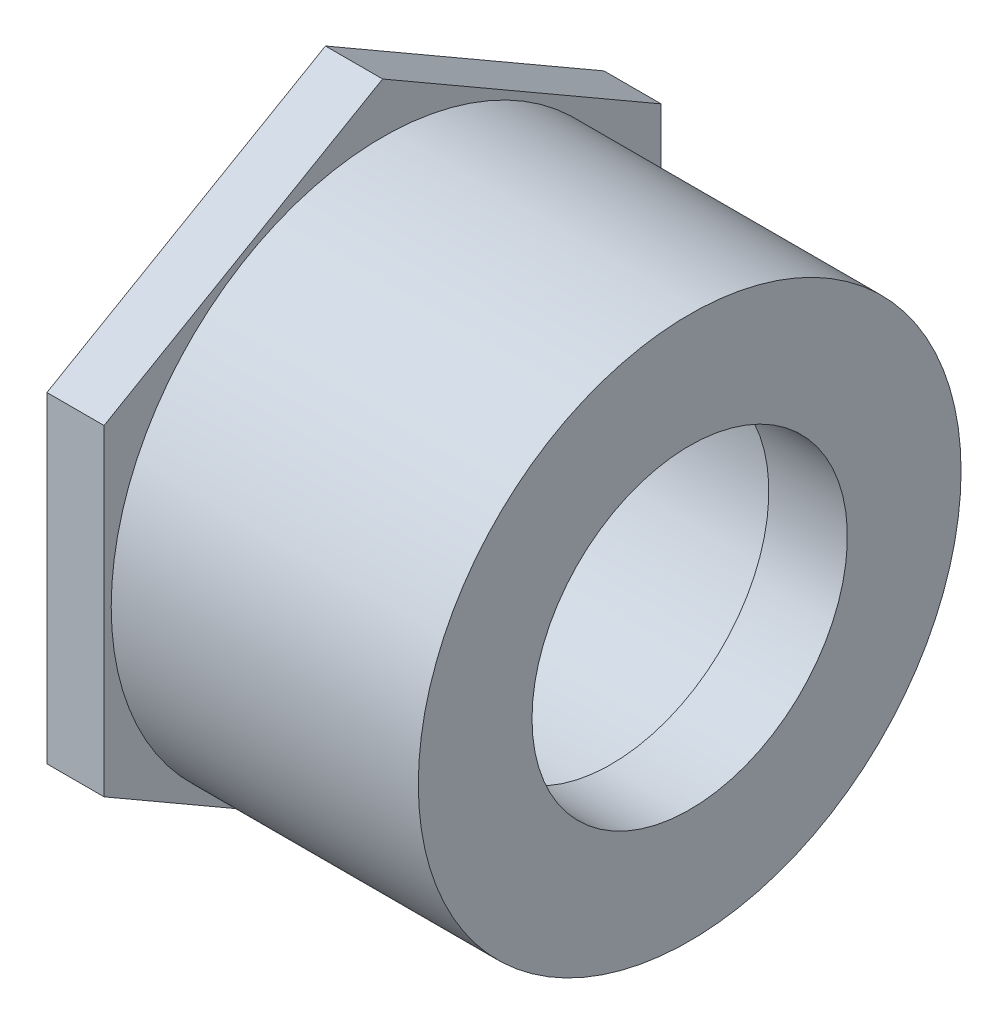
ISO-10303-21;
HEADER;
FILE_DESCRIPTION(('STEP AP214'),'2;1');
FILE_NAME('part.step','',(''),(''),'','','');
FILE_SCHEMA(('AUTOMOTIVE_DESIGN { 1 0 10303 214 1 1 1 1 }'));
ENDSEC;
DATA;
#1=APPLICATION_CONTEXT('core data for automotive mechanical design processes');
#2=APPLICATION_PROTOCOL_DEFINITION('international standard','automotive_design',2000,#1);
#3=PRODUCT_CONTEXT('',#1,'mechanical');
#4=PRODUCT('Part','Part','',(#3));
#5=PRODUCT_RELATED_PRODUCT_CATEGORY('part','',(#4));
#6=PRODUCT_DEFINITION_FORMATION('','',#4);
#7=PRODUCT_DEFINITION_CONTEXT('part definition',#1,'design');
#8=PRODUCT_DEFINITION('design','',#6,#7);
#9=PRODUCT_DEFINITION_SHAPE('','',#8);
#10=(LENGTH_UNIT() NAMED_UNIT(*) SI_UNIT(.MILLI.,.METRE.));
#11=(NAMED_UNIT(*) PLANE_ANGLE_UNIT() SI_UNIT($,.RADIAN.));
#12=(NAMED_UNIT(*) SI_UNIT($,.STERADIAN.) SOLID_ANGLE_UNIT());
#13=UNCERTAINTY_MEASURE_WITH_UNIT(LENGTH_MEASURE(1.E-05),#10,'distance_accuracy_value','');
#14=(GEOMETRIC_REPRESENTATION_CONTEXT(3) GLOBAL_UNCERTAINTY_ASSIGNED_CONTEXT((#13)) GLOBAL_UNIT_ASSIGNED_CONTEXT((#10,
#11,#12)) REPRESENTATION_CONTEXT('',''));
#15=CARTESIAN_POINT('',(0.,0.,0.));
#16=DIRECTION('',(0.,0.,1.));
#17=DIRECTION('',(1.,0.,0.));
#18=AXIS2_PLACEMENT_3D('',#15,#16,#17);
#19=CARTESIAN_POINT('',(-40.48125,0.,0.));
#20=DIRECTION('',(-1.,0.,0.));
#21=DIRECTION('',(0.,0.,1.));
#22=AXIS2_PLACEMENT_3D('',#19,#20,#21);
#23=CYLINDRICAL_SURFACE('',#22,30.1625);
#24=CARTESIAN_POINT('',(0.,0.,0.));
#25=DIRECTION('',(-1.,0.,0.));
#26=DIRECTION('',(0.,0.,1.));
#27=AXIS2_PLACEMENT_3D('',#24,#25,#26);
#28=CIRCLE('',#27,30.1625);
#29=CARTESIAN_POINT('',(0.,0.,30.1625));
#30=VERTEX_POINT('',#29);
#31=EDGE_CURVE('E145',#30,#30,#28,.T.);
#32=ORIENTED_EDGE('',*,*,#31,.T.);
#33=EDGE_LOOP('',(#32));
#34=FACE_BOUND('',#33,.T.);
#35=CARTESIAN_POINT('',(-34.13125,0.,0.));
#36=DIRECTION('',(-1.,0.,0.));
#37=DIRECTION('',(0.,0.,1.));
#38=AXIS2_PLACEMENT_3D('',#35,#36,#37);
#39=CIRCLE('',#38,30.1625);
#40=CARTESIAN_POINT('',(-34.13125,0.,30.1625));
#41=VERTEX_POINT('',#40);
#42=EDGE_CURVE('E38',#41,#41,#39,.F.);
#43=ORIENTED_EDGE('',*,*,#42,.T.);
#44=EDGE_LOOP('',(#43));
#45=FACE_BOUND('',#44,.T.);
#46=ADVANCED_FACE('F34',(#34,#45),#23,.T.);
#47=CARTESIAN_POINT('',(-40.48125,-30.1625,0.));
#48=DIRECTION('',(-1.,0.,0.));
#49=DIRECTION('',(0.,0.,1.));
#50=AXIS2_PLACEMENT_3D('',#47,#48,#49);
#51=PLANE('',#50);
#52=CARTESIAN_POINT('',(-40.48125,0.,0.));
#53=DIRECTION('',(-1.,0.,0.));
#54=DIRECTION('',(0.,0.,1.));
#55=AXIS2_PLACEMENT_3D('',#52,#53,#54);
#56=CIRCLE('',#55,21.209);
#57=CARTESIAN_POINT('',(-40.48125,0.,21.209));
#58=VERTEX_POINT('',#57);
#59=EDGE_CURVE('E11',#58,#58,#56,.T.);
#60=ORIENTED_EDGE('',*,*,#59,.F.);
#61=EDGE_LOOP('',(#60));
#62=FACE_BOUND('',#61,.T.);
#63=DIRECTION('',(0.,0.5,-0.866025403784439));
#64=VECTOR('',#63,1.);
#65=CARTESIAN_POINT('',(-40.48125,17.8725992706014,30.95625));
#66=LINE('',#65,#64);
#67=CARTESIAN_POINT('',(-40.48125,17.8725992706014,30.95625));
#68=VERTEX_POINT('',#67);
#69=CARTESIAN_POINT('',(-40.48125,35.7451985412027,0.));
#70=VERTEX_POINT('',#69);
#71=EDGE_CURVE('E123',#68,#70,#66,.T.);
#72=ORIENTED_EDGE('',*,*,#71,.T.);
#73=DIRECTION('',(0.,-0.5,-0.866025403784439));
#74=VECTOR('',#73,1.);
#75=CARTESIAN_POINT('',(-40.48125,35.7451985412027,0.));
#76=LINE('',#75,#74);
#77=CARTESIAN_POINT('',(-40.48125,17.8725992706014,-30.95625));
#78=VERTEX_POINT('',#77);
#79=EDGE_CURVE('E126',#70,#78,#76,.T.);
#80=ORIENTED_EDGE('',*,*,#79,.T.);
#81=DIRECTION('',(0.,-1.,0.));
#82=VECTOR('',#81,1.);
#83=CARTESIAN_POINT('',(-40.48125,17.8725992706014,-30.95625));
#84=LINE('',#83,#82);
#85=CARTESIAN_POINT('',(-40.48125,-17.8725992706013,-30.95625));
#86=VERTEX_POINT('',#85);
#87=EDGE_CURVE('E129',#78,#86,#84,.T.);
#88=ORIENTED_EDGE('',*,*,#87,.T.);
#89=DIRECTION('',(0.,-0.5,0.866025403784439));
#90=VECTOR('',#89,1.);
#91=CARTESIAN_POINT('',(-40.48125,-17.8725992706013,-30.95625));
#92=LINE('',#91,#90);
#93=CARTESIAN_POINT('',(-40.48125,-35.7451985412027,0.));
#94=VERTEX_POINT('',#93);
#95=EDGE_CURVE('E132',#86,#94,#92,.T.);
#96=ORIENTED_EDGE('',*,*,#95,.T.);
#97=DIRECTION('',(0.,0.5,0.866025403784439));
#98=VECTOR('',#97,1.);
#99=CARTESIAN_POINT('',(-40.48125,-35.7451985412027,0.));
#100=LINE('',#99,#98);
#101=CARTESIAN_POINT('',(-40.48125,-17.8725992706014,30.95625));
#102=VERTEX_POINT('',#101);
#103=EDGE_CURVE('E100',#94,#102,#100,.T.);
#104=ORIENTED_EDGE('',*,*,#103,.T.);
#105=DIRECTION('',(0.,1.,0.));
#106=VECTOR('',#105,1.);
#107=CARTESIAN_POINT('',(-40.48125,-17.8725992706014,30.95625));
#108=LINE('',#107,#106);
#109=EDGE_CURVE('E135',#102,#68,#108,.T.);
#110=ORIENTED_EDGE('',*,*,#109,.T.);
#111=EDGE_LOOP('',(#72,#80,#88,#96,#104,#110));
#112=FACE_BOUND('',#111,.T.);
#113=ADVANCED_FACE('F36',(#62,#112),#51,.T.);
#114=CARTESIAN_POINT('',(-8.73125,0.,0.));
#115=DIRECTION('',(-1.,0.,0.));
#116=DIRECTION('',(0.,0.,1.));
#117=AXIS2_PLACEMENT_3D('',#114,#115,#116);
#118=CONICAL_SURFACE('',#117,21.0185,0.00599992800155515);
#119=ORIENTED_EDGE('',*,*,#59,.T.);
#120=EDGE_LOOP('',(#119));
#121=FACE_BOUND('',#120,.T.);
#122=CARTESIAN_POINT('',(-8.73125,0.,0.));
#123=DIRECTION('',(-1.,0.,0.));
#124=DIRECTION('',(0.,0.,1.));
#125=AXIS2_PLACEMENT_3D('',#122,#123,#124);
#126=CIRCLE('',#125,21.0185);
#127=CARTESIAN_POINT('',(-8.73125,0.,21.0185));
#128=VERTEX_POINT('',#127);
#129=EDGE_CURVE('E44',#128,#128,#126,.T.);
#130=ORIENTED_EDGE('',*,*,#129,.F.);
#131=EDGE_LOOP('',(#130));
#132=FACE_BOUND('',#131,.T.);
#133=ADVANCED_FACE('F160',(#121,#132),#118,.F.);
#134=CARTESIAN_POINT('',(-8.73125,-17.526,0.));
#135=DIRECTION('',(-1.,0.,0.));
#136=DIRECTION('',(0.,0.,1.));
#137=AXIS2_PLACEMENT_3D('',#134,#135,#136);
#138=PLANE('',#137);
#139=ORIENTED_EDGE('',*,*,#129,.T.);
#140=EDGE_LOOP('',(#139));
#141=FACE_BOUND('',#140,.T.);
#142=CARTESIAN_POINT('',(-8.73125,0.,0.));
#143=DIRECTION('',(-1.,0.,0.));
#144=DIRECTION('',(0.,0.,1.));
#145=AXIS2_PLACEMENT_3D('',#142,#143,#144);
#146=CIRCLE('',#145,17.526);
#147=CARTESIAN_POINT('',(-8.73125,0.,17.526));
#148=VERTEX_POINT('',#147);
#149=EDGE_CURVE('E151',#148,#148,#146,.T.);
#150=ORIENTED_EDGE('',*,*,#149,.F.);
#151=EDGE_LOOP('',(#150));
#152=FACE_BOUND('',#151,.T.);
#153=ADVANCED_FACE('F157',(#141,#152),#138,.T.);
#154=CARTESIAN_POINT('',(-40.48125,0.,0.));
#155=DIRECTION('',(-1.,0.,0.));
#156=DIRECTION('',(0.,0.,1.));
#157=AXIS2_PLACEMENT_3D('',#154,#155,#156);
#158=CYLINDRICAL_SURFACE('',#157,17.526);
#159=ORIENTED_EDGE('',*,*,#149,.T.);
#160=EDGE_LOOP('',(#159));
#161=FACE_BOUND('',#160,.T.);
#162=CARTESIAN_POINT('',(0.,0.,0.));
#163=DIRECTION('',(-1.,0.,0.));
#164=DIRECTION('',(0.,0.,1.));
#165=AXIS2_PLACEMENT_3D('',#162,#163,#164);
#166=CIRCLE('',#165,17.526);
#167=CARTESIAN_POINT('',(0.,0.,17.526));
#168=VERTEX_POINT('',#167);
#169=EDGE_CURVE('E148',#168,#168,#166,.T.);
#170=ORIENTED_EDGE('',*,*,#169,.F.);
#171=EDGE_LOOP('',(#170));
#172=FACE_BOUND('',#171,.T.);
#173=ADVANCED_FACE('F167',(#161,#172),#158,.F.);
#174=CARTESIAN_POINT('',(0.,-17.526,0.));
#175=DIRECTION('',(1.,0.,0.));
#176=DIRECTION('',(0.,0.,-1.));
#177=AXIS2_PLACEMENT_3D('',#174,#175,#176);
#178=PLANE('',#177);
#179=ORIENTED_EDGE('',*,*,#169,.T.);
#180=EDGE_LOOP('',(#179));
#181=FACE_BOUND('',#180,.T.);
#182=ORIENTED_EDGE('',*,*,#31,.F.);
#183=EDGE_LOOP('',(#182));
#184=FACE_BOUND('',#183,.T.);
#185=ADVANCED_FACE('F180',(#181,#184),#178,.T.);
#186=CARTESIAN_POINT('',(-34.13125,17.8725992706014,30.95625));
#187=DIRECTION('',(0.,0.866025403784439,0.5));
#188=DIRECTION('',(0.,-0.5,0.866025403784439));
#189=AXIS2_PLACEMENT_3D('',#186,#187,#188);
#190=PLANE('',#189);
#191=ORIENTED_EDGE('',*,*,#71,.F.);
#192=DIRECTION('',(-1.,0.,0.));
#193=VECTOR('',#192,1.);
#194=CARTESIAN_POINT('',(-34.13125,17.8725992706014,30.95625));
#195=LINE('',#194,#193);
#196=CARTESIAN_POINT('',(-34.13125,17.8725992706014,30.95625));
#197=VERTEX_POINT('',#196);
#198=EDGE_CURVE('E52',#197,#68,#195,.T.);
#199=ORIENTED_EDGE('',*,*,#198,.F.);
#200=DIRECTION('',(0.,0.5,-0.866025403784439));
#201=VECTOR('',#200,1.);
#202=CARTESIAN_POINT('',(-34.13125,17.8725992706014,30.95625));
#203=LINE('',#202,#201);
#204=CARTESIAN_POINT('',(-34.13125,35.7451985412027,0.));
#205=VERTEX_POINT('',#204);
#206=EDGE_CURVE('E138',#197,#205,#203,.T.);
#207=ORIENTED_EDGE('',*,*,#206,.T.);
#208=DIRECTION('',(-1.,0.,0.));
#209=VECTOR('',#208,1.);
#210=CARTESIAN_POINT('',(-34.13125,35.7451985412027,0.));
#211=LINE('',#210,#209);
#212=EDGE_CURVE('E87',#205,#70,#211,.T.);
#213=ORIENTED_EDGE('',*,*,#212,.T.);
#214=EDGE_LOOP('',(#191,#199,#207,#213));
#215=FACE_BOUND('',#214,.T.);
#216=ADVANCED_FACE('F178',(#215),#190,.T.);
#217=CARTESIAN_POINT('',(-34.13125,-17.8725992706014,30.95625));
#218=DIRECTION('',(0.,0.,1.));
#219=DIRECTION('',(0.,-1.,0.));
#220=AXIS2_PLACEMENT_3D('',#217,#218,#219);
#221=PLANE('',#220);
#222=ORIENTED_EDGE('',*,*,#109,.F.);
#223=DIRECTION('',(-1.,0.,0.));
#224=VECTOR('',#223,1.);
#225=CARTESIAN_POINT('',(-34.13125,-17.8725992706014,30.95625));
#226=LINE('',#225,#224);
#227=CARTESIAN_POINT('',(-34.13125,-17.8725992706014,30.95625));
#228=VERTEX_POINT('',#227);
#229=EDGE_CURVE('E75',#228,#102,#226,.T.);
#230=ORIENTED_EDGE('',*,*,#229,.F.);
#231=DIRECTION('',(0.,1.,0.));
#232=VECTOR('',#231,1.);
#233=CARTESIAN_POINT('',(-34.13125,-17.8725992706014,30.95625));
#234=LINE('',#233,#232);
#235=EDGE_CURVE('E113',#228,#197,#234,.T.);
#236=ORIENTED_EDGE('',*,*,#235,.T.);
#237=ORIENTED_EDGE('',*,*,#198,.T.);
#238=EDGE_LOOP('',(#222,#230,#236,#237));
#239=FACE_BOUND('',#238,.T.);
#240=ADVANCED_FACE('F205',(#239),#221,.T.);
#241=CARTESIAN_POINT('',(-34.13125,-35.7451985412027,0.));
#242=DIRECTION('',(0.,-0.866025403784439,0.5));
#243=DIRECTION('',(0.,-0.5,-0.866025403784438));
#244=AXIS2_PLACEMENT_3D('',#241,#242,#243);
#245=PLANE('',#244);
#246=ORIENTED_EDGE('',*,*,#103,.F.);
#247=DIRECTION('',(-1.,0.,0.));
#248=VECTOR('',#247,1.);
#249=CARTESIAN_POINT('',(-34.13125,-35.7451985412027,0.));
#250=LINE('',#249,#248);
#251=CARTESIAN_POINT('',(-34.13125,-35.7451985412027,0.));
#252=VERTEX_POINT('',#251);
#253=EDGE_CURVE('E95',#252,#94,#250,.T.);
#254=ORIENTED_EDGE('',*,*,#253,.F.);
#255=DIRECTION('',(0.,0.5,0.866025403784439));
#256=VECTOR('',#255,1.);
#257=CARTESIAN_POINT('',(-34.13125,-35.7451985412027,0.));
#258=LINE('',#257,#256);
#259=EDGE_CURVE('E98',#252,#228,#258,.T.);
#260=ORIENTED_EDGE('',*,*,#259,.T.);
#261=ORIENTED_EDGE('',*,*,#229,.T.);
#262=EDGE_LOOP('',(#246,#254,#260,#261));
#263=FACE_BOUND('',#262,.T.);
#264=ADVANCED_FACE('F97',(#263),#245,.T.);
#265=CARTESIAN_POINT('',(-34.13125,-17.8725992706013,-30.95625));
#266=DIRECTION('',(0.,-0.866025403784439,-0.5));
#267=DIRECTION('',(0.,0.5,-0.866025403784438));
#268=AXIS2_PLACEMENT_3D('',#265,#266,#267);
#269=PLANE('',#268);
#270=ORIENTED_EDGE('',*,*,#95,.F.);
#271=DIRECTION('',(-1.,0.,0.));
#272=VECTOR('',#271,1.);
#273=CARTESIAN_POINT('',(-34.13125,-17.8725992706013,-30.95625));
#274=LINE('',#273,#272);
#275=CARTESIAN_POINT('',(-34.13125,-17.8725992706013,-30.95625));
#276=VERTEX_POINT('',#275);
#277=EDGE_CURVE('E105',#276,#86,#274,.T.);
#278=ORIENTED_EDGE('',*,*,#277,.F.);
#279=DIRECTION('',(0.,-0.5,0.866025403784439));
#280=VECTOR('',#279,1.);
#281=CARTESIAN_POINT('',(-34.13125,-17.8725992706013,-30.95625));
#282=LINE('',#281,#280);
#283=EDGE_CURVE('E111',#276,#252,#282,.T.);
#284=ORIENTED_EDGE('',*,*,#283,.T.);
#285=ORIENTED_EDGE('',*,*,#253,.T.);
#286=EDGE_LOOP('',(#270,#278,#284,#285));
#287=FACE_BOUND('',#286,.T.);
#288=ADVANCED_FACE('F115',(#287),#269,.T.);
#289=CARTESIAN_POINT('',(-34.13125,17.8725992706014,-30.95625));
#290=DIRECTION('',(0.,0.,-1.));
#291=DIRECTION('',(0.,1.,0.));
#292=AXIS2_PLACEMENT_3D('',#289,#290,#291);
#293=PLANE('',#292);
#294=ORIENTED_EDGE('',*,*,#87,.F.);
#295=DIRECTION('',(-1.,0.,0.));
#296=VECTOR('',#295,1.);
#297=CARTESIAN_POINT('',(-34.13125,17.8725992706014,-30.95625));
#298=LINE('',#297,#296);
#299=CARTESIAN_POINT('',(-34.13125,17.8725992706014,-30.95625));
#300=VERTEX_POINT('',#299);
#301=EDGE_CURVE('E142',#300,#78,#298,.T.);
#302=ORIENTED_EDGE('',*,*,#301,.F.);
#303=DIRECTION('',(0.,-1.,0.));
#304=VECTOR('',#303,1.);
#305=CARTESIAN_POINT('',(-34.13125,17.8725992706014,-30.95625));
#306=LINE('',#305,#304);
#307=EDGE_CURVE('E116',#300,#276,#306,.T.);
#308=ORIENTED_EDGE('',*,*,#307,.T.);
#309=ORIENTED_EDGE('',*,*,#277,.T.);
#310=EDGE_LOOP('',(#294,#302,#308,#309));
#311=FACE_BOUND('',#310,.T.);
#312=ADVANCED_FACE('F224',(#311),#293,.T.);
#313=CARTESIAN_POINT('',(-34.13125,35.7451985412027,0.));
#314=DIRECTION('',(0.,0.866025403784439,-0.5));
#315=DIRECTION('',(0.,0.5,0.866025403784439));
#316=AXIS2_PLACEMENT_3D('',#313,#314,#315);
#317=PLANE('',#316);
#318=ORIENTED_EDGE('',*,*,#79,.F.);
#319=ORIENTED_EDGE('',*,*,#212,.F.);
#320=DIRECTION('',(0.,-0.5,-0.866025403784439));
#321=VECTOR('',#320,1.);
#322=CARTESIAN_POINT('',(-34.13125,35.7451985412027,0.));
#323=LINE('',#322,#321);
#324=EDGE_CURVE('E118',#205,#300,#323,.T.);
#325=ORIENTED_EDGE('',*,*,#324,.T.);
#326=ORIENTED_EDGE('',*,*,#301,.T.);
#327=EDGE_LOOP('',(#318,#319,#325,#326));
#328=FACE_BOUND('',#327,.T.);
#329=ADVANCED_FACE('F231',(#328),#317,.T.);
#330=CARTESIAN_POINT('',(-34.13125,35.7451985412027,0.));
#331=DIRECTION('',(-1.,0.,0.));
#332=DIRECTION('',(0.,0.,1.));
#333=AXIS2_PLACEMENT_3D('',#330,#331,#332);
#334=PLANE('',#333);
#335=ORIENTED_EDGE('',*,*,#42,.F.);
#336=EDGE_LOOP('',(#335));
#337=FACE_BOUND('',#336,.T.);
#338=ORIENTED_EDGE('',*,*,#206,.F.);
#339=ORIENTED_EDGE('',*,*,#235,.F.);
#340=ORIENTED_EDGE('',*,*,#259,.F.);
#341=ORIENTED_EDGE('',*,*,#283,.F.);
#342=ORIENTED_EDGE('',*,*,#307,.F.);
#343=ORIENTED_EDGE('',*,*,#324,.F.);
#344=EDGE_LOOP('',(#338,#339,#340,#341,#342,#343));
#345=FACE_BOUND('',#344,.T.);
#346=ADVANCED_FACE('F109',(#337,#345),#334,.F.);
#347=CLOSED_SHELL('',(#46,#113,#133,#153,#173,#185,#216,#240,#264,#288,#312,#329,#346));
#348=MANIFOLD_SOLID_BREP('B2',#347);
#349=ADVANCED_BREP_SHAPE_REPRESENTATION('',(#18,#348),#14);
#350=SHAPE_DEFINITION_REPRESENTATION(#9,#349);
ENDSEC;
END-ISO-10303-21;
